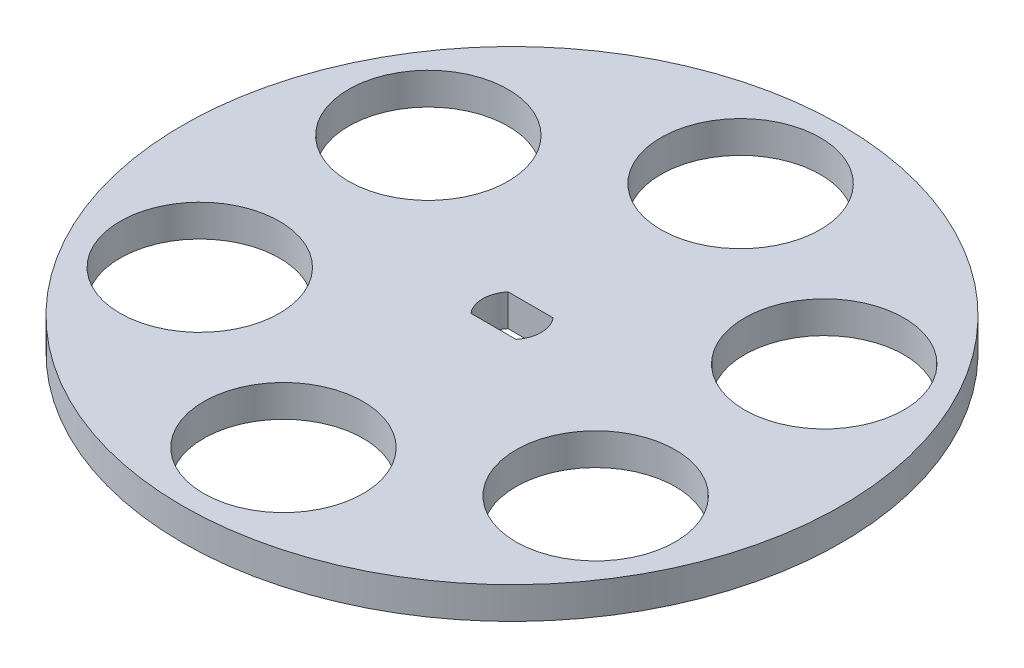
ISO-10303-21;
HEADER;
FILE_DESCRIPTION(('STEP AP214'),'2;1');
FILE_NAME('part.step','',(''),(''),'','','');
FILE_SCHEMA(('AUTOMOTIVE_DESIGN { 1 0 10303 214 1 1 1 1 }'));
ENDSEC;
DATA;
#1=APPLICATION_CONTEXT('core data for automotive mechanical design processes');
#2=APPLICATION_PROTOCOL_DEFINITION('international standard','automotive_design',2000,#1);
#3=PRODUCT_CONTEXT('',#1,'mechanical');
#4=PRODUCT('Part','Part','',(#3));
#5=PRODUCT_RELATED_PRODUCT_CATEGORY('part','',(#4));
#6=PRODUCT_DEFINITION_FORMATION('','',#4);
#7=PRODUCT_DEFINITION_CONTEXT('part definition',#1,'design');
#8=PRODUCT_DEFINITION('design','',#6,#7);
#9=PRODUCT_DEFINITION_SHAPE('','',#8);
#10=(LENGTH_UNIT() NAMED_UNIT(*) SI_UNIT(.MILLI.,.METRE.));
#11=(NAMED_UNIT(*) PLANE_ANGLE_UNIT() SI_UNIT($,.RADIAN.));
#12=(NAMED_UNIT(*) SI_UNIT($,.STERADIAN.) SOLID_ANGLE_UNIT());
#13=UNCERTAINTY_MEASURE_WITH_UNIT(LENGTH_MEASURE(1.E-05),#10,'distance_accuracy_value','');
#14=(GEOMETRIC_REPRESENTATION_CONTEXT(3) GLOBAL_UNCERTAINTY_ASSIGNED_CONTEXT((#13)) GLOBAL_UNIT_ASSIGNED_CONTEXT((#10,
#11,#12)) REPRESENTATION_CONTEXT('',''));
#15=CARTESIAN_POINT('',(0.,0.,0.));
#16=DIRECTION('',(0.,0.,1.));
#17=DIRECTION('',(1.,0.,0.));
#18=AXIS2_PLACEMENT_3D('',#15,#16,#17);
#19=CARTESIAN_POINT('',(0.,3.,0.));
#20=DIRECTION('',(0.,1.,0.));
#21=DIRECTION('',(0.,0.,1.));
#22=AXIS2_PLACEMENT_3D('',#19,#20,#21);
#23=PLANE('',#22);
#24=CARTESIAN_POINT('',(-18.6195461813641,3.,10.7500000000008));
#25=DIRECTION('',(0.,1.,0.));
#26=DIRECTION('',(0.,0.,1.));
#27=AXIS2_PLACEMENT_3D('',#24,#25,#26);
#28=CIRCLE('',#27,7.50000000000174);
#29=CARTESIAN_POINT('',(-18.6195461813641,3.,18.2500000000025));
#30=VERTEX_POINT('',#29);
#31=EDGE_CURVE('E226',#30,#30,#28,.T.);
#32=ORIENTED_EDGE('',*,*,#31,.F.);
#33=EDGE_LOOP('',(#32));
#34=FACE_BOUND('',#33,.T.);
#35=CARTESIAN_POINT('',(18.6195461813668,3.,10.7499999999992));
#36=DIRECTION('',(0.,1.,0.));
#37=DIRECTION('',(0.,0.,1.));
#38=AXIS2_PLACEMENT_3D('',#35,#36,#37);
#39=CIRCLE('',#38,7.50000000000118);
#40=CARTESIAN_POINT('',(18.6195461813668,3.,18.2500000000004));
#41=VERTEX_POINT('',#40);
#42=EDGE_CURVE('E238',#41,#41,#39,.T.);
#43=ORIENTED_EDGE('',*,*,#42,.F.);
#44=EDGE_LOOP('',(#43));
#45=FACE_BOUND('',#44,.T.);
#46=CARTESIAN_POINT('',(0.,3.,-21.5));
#47=DIRECTION('',(0.,1.,0.));
#48=DIRECTION('',(0.,0.,1.));
#49=AXIS2_PLACEMENT_3D('',#46,#47,#48);
#50=CIRCLE('',#49,7.5);
#51=CARTESIAN_POINT('',(0.,3.,-14.));
#52=VERTEX_POINT('',#51);
#53=EDGE_CURVE('E102',#52,#52,#50,.T.);
#54=ORIENTED_EDGE('',*,*,#53,.F.);
#55=EDGE_LOOP('',(#54));
#56=FACE_BOUND('',#55,.T.);
#57=CARTESIAN_POINT('',(0.,3.,0.));
#58=DIRECTION('',(0.,1.,0.));
#59=DIRECTION('',(0.,0.,1.));
#60=AXIS2_PLACEMENT_3D('',#57,#58,#59);
#61=CIRCLE('',#60,31.);
#62=CARTESIAN_POINT('',(0.,3.,31.));
#63=VERTEX_POINT('',#62);
#64=EDGE_CURVE('E11',#63,#63,#61,.T.);
#65=ORIENTED_EDGE('',*,*,#64,.T.);
#66=EDGE_LOOP('',(#65));
#67=FACE_BOUND('',#66,.T.);
#68=DIRECTION('',(1.,0.,0.));
#69=VECTOR('',#68,1.);
#70=CARTESIAN_POINT('',(-2.12132034355964,3.,1.75));
#71=LINE('',#70,#69);
#72=CARTESIAN_POINT('',(-2.12132034355964,3.,1.75));
#73=VERTEX_POINT('',#72);
#74=CARTESIAN_POINT('',(2.12132034355964,3.,1.75));
#75=VERTEX_POINT('',#74);
#76=EDGE_CURVE('E82',#73,#75,#71,.T.);
#77=ORIENTED_EDGE('',*,*,#76,.F.);
#78=CARTESIAN_POINT('',(0.,3.,0.));
#79=DIRECTION('',(0.,1.,0.));
#80=DIRECTION('',(0.,0.,1.));
#81=AXIS2_PLACEMENT_3D('',#78,#79,#80);
#82=CIRCLE('',#81,2.75);
#83=CARTESIAN_POINT('',(-2.12132034355964,3.,-1.75));
#84=VERTEX_POINT('',#83);
#85=EDGE_CURVE('E74',#84,#73,#82,.T.);
#86=ORIENTED_EDGE('',*,*,#85,.F.);
#87=DIRECTION('',(-1.,0.,0.));
#88=VECTOR('',#87,1.);
#89=CARTESIAN_POINT('',(-2.12132034355964,3.,-1.75));
#90=LINE('',#89,#88);
#91=CARTESIAN_POINT('',(2.12132034355964,3.,-1.75));
#92=VERTEX_POINT('',#91);
#93=EDGE_CURVE('E96',#92,#84,#90,.T.);
#94=ORIENTED_EDGE('',*,*,#93,.F.);
#95=CARTESIAN_POINT('',(0.,3.,0.));
#96=DIRECTION('',(0.,1.,0.));
#97=DIRECTION('',(0.,0.,1.));
#98=AXIS2_PLACEMENT_3D('',#95,#96,#97);
#99=CIRCLE('',#98,2.75);
#100=EDGE_CURVE('E94',#75,#92,#99,.T.);
#101=ORIENTED_EDGE('',*,*,#100,.F.);
#102=EDGE_LOOP('',(#77,#86,#94,#101));
#103=FACE_BOUND('',#102,.T.);
#104=CARTESIAN_POINT('',(18.6195461813659,3.,-10.7500000000008));
#105=DIRECTION('',(0.,1.,0.));
#106=DIRECTION('',(0.,0.,1.));
#107=AXIS2_PLACEMENT_3D('',#104,#105,#106);
#108=CIRCLE('',#107,7.50000000000026);
#109=CARTESIAN_POINT('',(18.6195461813659,3.,-3.25000000000054));
#110=VERTEX_POINT('',#109);
#111=EDGE_CURVE('E244',#110,#110,#108,.T.);
#112=ORIENTED_EDGE('',*,*,#111,.F.);
#113=EDGE_LOOP('',(#112));
#114=FACE_BOUND('',#113,.T.);
#115=CARTESIAN_POINT('',(1.82530128640656E-12,3.,21.5));
#116=DIRECTION('',(0.,1.,0.));
#117=DIRECTION('',(0.,0.,1.));
#118=AXIS2_PLACEMENT_3D('',#115,#116,#117);
#119=CIRCLE('',#118,7.50000000000189);
#120=CARTESIAN_POINT('',(1.82530128640656E-12,3.,29.0000000000019));
#121=VERTEX_POINT('',#120);
#122=EDGE_CURVE('E232',#121,#121,#119,.T.);
#123=ORIENTED_EDGE('',*,*,#122,.F.);
#124=EDGE_LOOP('',(#123));
#125=FACE_BOUND('',#124,.T.);
#126=CARTESIAN_POINT('',(-18.619546181365,3.,-10.7499999999992));
#127=DIRECTION('',(0.,1.,0.));
#128=DIRECTION('',(0.,0.,1.));
#129=AXIS2_PLACEMENT_3D('',#126,#127,#128);
#130=CIRCLE('',#129,7.50000000000092);
#131=CARTESIAN_POINT('',(-18.619546181365,3.,-3.24999999999827));
#132=VERTEX_POINT('',#131);
#133=EDGE_CURVE('E217',#132,#132,#130,.T.);
#134=ORIENTED_EDGE('',*,*,#133,.F.);
#135=EDGE_LOOP('',(#134));
#136=FACE_BOUND('',#135,.T.);
#137=ADVANCED_FACE('F33',(#34,#45,#56,#67,#103,#114,#125,#136),#23,.T.);
#138=CARTESIAN_POINT('',(0.,0.,0.));
#139=DIRECTION('',(0.,1.,0.));
#140=DIRECTION('',(0.,0.,1.));
#141=AXIS2_PLACEMENT_3D('',#138,#139,#140);
#142=PLANE('',#141);
#143=CARTESIAN_POINT('',(0.,0.,0.));
#144=DIRECTION('',(0.,1.,0.));
#145=DIRECTION('',(0.,0.,1.));
#146=AXIS2_PLACEMENT_3D('',#143,#144,#145);
#147=CIRCLE('',#146,31.);
#148=CARTESIAN_POINT('',(0.,0.,31.));
#149=VERTEX_POINT('',#148);
#150=EDGE_CURVE('E37',#149,#149,#147,.T.);
#151=ORIENTED_EDGE('',*,*,#150,.F.);
#152=EDGE_LOOP('',(#151));
#153=FACE_BOUND('',#152,.T.);
#154=CARTESIAN_POINT('',(0.,0.,0.));
#155=DIRECTION('',(0.,1.,0.));
#156=DIRECTION('',(0.,0.,1.));
#157=AXIS2_PLACEMENT_3D('',#154,#155,#156);
#158=CIRCLE('',#157,2.75);
#159=CARTESIAN_POINT('',(-2.12132034355964,0.,-1.75));
#160=VERTEX_POINT('',#159);
#161=CARTESIAN_POINT('',(-2.12132034355964,0.,1.75));
#162=VERTEX_POINT('',#161);
#163=EDGE_CURVE('E56',#160,#162,#158,.T.);
#164=ORIENTED_EDGE('',*,*,#163,.T.);
#165=DIRECTION('',(1.,0.,0.));
#166=VECTOR('',#165,1.);
#167=CARTESIAN_POINT('',(-2.12132034355964,0.,1.75));
#168=LINE('',#167,#166);
#169=CARTESIAN_POINT('',(2.12132034355964,0.,1.75));
#170=VERTEX_POINT('',#169);
#171=EDGE_CURVE('E89',#162,#170,#168,.T.);
#172=ORIENTED_EDGE('',*,*,#171,.T.);
#173=CARTESIAN_POINT('',(0.,0.,0.));
#174=DIRECTION('',(0.,1.,0.));
#175=DIRECTION('',(0.,0.,1.));
#176=AXIS2_PLACEMENT_3D('',#173,#174,#175);
#177=CIRCLE('',#176,2.75);
#178=CARTESIAN_POINT('',(2.12132034355964,0.,-1.75));
#179=VERTEX_POINT('',#178);
#180=EDGE_CURVE('E104',#170,#179,#177,.T.);
#181=ORIENTED_EDGE('',*,*,#180,.T.);
#182=DIRECTION('',(-1.,0.,0.));
#183=VECTOR('',#182,1.);
#184=CARTESIAN_POINT('',(-2.12132034355964,0.,-1.75));
#185=LINE('',#184,#183);
#186=EDGE_CURVE('E83',#179,#160,#185,.T.);
#187=ORIENTED_EDGE('',*,*,#186,.T.);
#188=EDGE_LOOP('',(#164,#172,#181,#187));
#189=FACE_BOUND('',#188,.T.);
#190=CARTESIAN_POINT('',(0.,0.,-21.5));
#191=DIRECTION('',(0.,1.,0.));
#192=DIRECTION('',(0.,0.,1.));
#193=AXIS2_PLACEMENT_3D('',#190,#191,#192);
#194=CIRCLE('',#193,7.5);
#195=CARTESIAN_POINT('',(0.,0.,-14.));
#196=VERTEX_POINT('',#195);
#197=EDGE_CURVE('E247',#196,#196,#194,.T.);
#198=ORIENTED_EDGE('',*,*,#197,.T.);
#199=EDGE_LOOP('',(#198));
#200=FACE_BOUND('',#199,.T.);
#201=CARTESIAN_POINT('',(18.6195461813659,0.,-10.7500000000008));
#202=DIRECTION('',(0.,1.,0.));
#203=DIRECTION('',(0.,0.,1.));
#204=AXIS2_PLACEMENT_3D('',#201,#202,#203);
#205=CIRCLE('',#204,7.50000000000026);
#206=CARTESIAN_POINT('',(18.6195461813659,0.,-3.25000000000054));
#207=VERTEX_POINT('',#206);
#208=EDGE_CURVE('E241',#207,#207,#205,.T.);
#209=ORIENTED_EDGE('',*,*,#208,.T.);
#210=EDGE_LOOP('',(#209));
#211=FACE_BOUND('',#210,.T.);
#212=CARTESIAN_POINT('',(18.6195461813668,0.,10.7499999999992));
#213=DIRECTION('',(0.,1.,0.));
#214=DIRECTION('',(0.,0.,1.));
#215=AXIS2_PLACEMENT_3D('',#212,#213,#214);
#216=CIRCLE('',#215,7.50000000000118);
#217=CARTESIAN_POINT('',(18.6195461813668,0.,18.2500000000004));
#218=VERTEX_POINT('',#217);
#219=EDGE_CURVE('E235',#218,#218,#216,.T.);
#220=ORIENTED_EDGE('',*,*,#219,.T.);
#221=EDGE_LOOP('',(#220));
#222=FACE_BOUND('',#221,.T.);
#223=CARTESIAN_POINT('',(1.82530128640656E-12,0.,21.5));
#224=DIRECTION('',(0.,1.,0.));
#225=DIRECTION('',(0.,0.,1.));
#226=AXIS2_PLACEMENT_3D('',#223,#224,#225);
#227=CIRCLE('',#226,7.50000000000189);
#228=CARTESIAN_POINT('',(1.82530128640656E-12,0.,29.0000000000019));
#229=VERTEX_POINT('',#228);
#230=EDGE_CURVE('E229',#229,#229,#227,.T.);
#231=ORIENTED_EDGE('',*,*,#230,.T.);
#232=EDGE_LOOP('',(#231));
#233=FACE_BOUND('',#232,.T.);
#234=CARTESIAN_POINT('',(-18.6195461813641,0.,10.7500000000008));
#235=DIRECTION('',(0.,1.,0.));
#236=DIRECTION('',(0.,0.,1.));
#237=AXIS2_PLACEMENT_3D('',#234,#235,#236);
#238=CIRCLE('',#237,7.50000000000174);
#239=CARTESIAN_POINT('',(-18.6195461813641,0.,18.2500000000025));
#240=VERTEX_POINT('',#239);
#241=EDGE_CURVE('E223',#240,#240,#238,.T.);
#242=ORIENTED_EDGE('',*,*,#241,.T.);
#243=EDGE_LOOP('',(#242));
#244=FACE_BOUND('',#243,.T.);
#245=CARTESIAN_POINT('',(-18.619546181365,0.,-10.7499999999992));
#246=DIRECTION('',(0.,1.,0.));
#247=DIRECTION('',(0.,0.,1.));
#248=AXIS2_PLACEMENT_3D('',#245,#246,#247);
#249=CIRCLE('',#248,7.50000000000092);
#250=CARTESIAN_POINT('',(-18.619546181365,0.,-3.24999999999827));
#251=VERTEX_POINT('',#250);
#252=EDGE_CURVE('E220',#251,#251,#249,.T.);
#253=ORIENTED_EDGE('',*,*,#252,.T.);
#254=EDGE_LOOP('',(#253));
#255=FACE_BOUND('',#254,.T.);
#256=ADVANCED_FACE('F115',(#153,#189,#200,#211,#222,#233,#244,#255),#142,.F.);
#257=CARTESIAN_POINT('',(0.,3.,0.));
#258=DIRECTION('',(0.,-1.,0.));
#259=DIRECTION('',(0.,0.,-1.));
#260=AXIS2_PLACEMENT_3D('',#257,#258,#259);
#261=CYLINDRICAL_SURFACE('',#260,31.);
#262=ORIENTED_EDGE('',*,*,#64,.F.);
#263=EDGE_LOOP('',(#262));
#264=FACE_BOUND('',#263,.T.);
#265=ORIENTED_EDGE('',*,*,#150,.T.);
#266=EDGE_LOOP('',(#265));
#267=FACE_BOUND('',#266,.T.);
#268=ADVANCED_FACE('F35',(#264,#267),#261,.T.);
#269=CARTESIAN_POINT('',(0.,3.,0.));
#270=DIRECTION('',(0.,-1.,0.));
#271=DIRECTION('',(0.,0.,-1.));
#272=AXIS2_PLACEMENT_3D('',#269,#270,#271);
#273=CYLINDRICAL_SURFACE('',#272,2.75);
#274=ORIENTED_EDGE('',*,*,#163,.F.);
#275=DIRECTION('',(0.,-1.,0.));
#276=VECTOR('',#275,1.);
#277=CARTESIAN_POINT('',(-2.12132034355964,3.,-1.75));
#278=LINE('',#277,#276);
#279=EDGE_CURVE('E78',#84,#160,#278,.T.);
#280=ORIENTED_EDGE('',*,*,#279,.F.);
#281=ORIENTED_EDGE('',*,*,#85,.T.);
#282=DIRECTION('',(0.,-1.,0.));
#283=VECTOR('',#282,1.);
#284=CARTESIAN_POINT('',(-2.12132034355964,3.,1.75));
#285=LINE('',#284,#283);
#286=EDGE_CURVE('E77',#73,#162,#285,.T.);
#287=ORIENTED_EDGE('',*,*,#286,.T.);
#288=EDGE_LOOP('',(#274,#280,#281,#287));
#289=FACE_BOUND('',#288,.T.);
#290=ADVANCED_FACE('F76',(#289),#273,.F.);
#291=CARTESIAN_POINT('',(-2.12132034355964,3.,1.75));
#292=DIRECTION('',(0.,0.,-1.));
#293=DIRECTION('',(-1.,0.,0.));
#294=AXIS2_PLACEMENT_3D('',#291,#292,#293);
#295=PLANE('',#294);
#296=ORIENTED_EDGE('',*,*,#171,.F.);
#297=ORIENTED_EDGE('',*,*,#286,.F.);
#298=ORIENTED_EDGE('',*,*,#76,.T.);
#299=DIRECTION('',(0.,-1.,0.));
#300=VECTOR('',#299,1.);
#301=CARTESIAN_POINT('',(2.12132034355964,3.,1.75));
#302=LINE('',#301,#300);
#303=EDGE_CURVE('E90',#75,#170,#302,.T.);
#304=ORIENTED_EDGE('',*,*,#303,.T.);
#305=EDGE_LOOP('',(#296,#297,#298,#304));
#306=FACE_BOUND('',#305,.T.);
#307=ADVANCED_FACE('F86',(#306),#295,.T.);
#308=CARTESIAN_POINT('',(0.,3.,0.));
#309=DIRECTION('',(0.,-1.,0.));
#310=DIRECTION('',(0.,0.,-1.));
#311=AXIS2_PLACEMENT_3D('',#308,#309,#310);
#312=CYLINDRICAL_SURFACE('',#311,2.75);
#313=ORIENTED_EDGE('',*,*,#180,.F.);
#314=ORIENTED_EDGE('',*,*,#303,.F.);
#315=ORIENTED_EDGE('',*,*,#100,.T.);
#316=DIRECTION('',(0.,-1.,0.));
#317=VECTOR('',#316,1.);
#318=CARTESIAN_POINT('',(2.12132034355964,3.,-1.75));
#319=LINE('',#318,#317);
#320=EDGE_CURVE('E48',#92,#179,#319,.T.);
#321=ORIENTED_EDGE('',*,*,#320,.T.);
#322=EDGE_LOOP('',(#313,#314,#315,#321));
#323=FACE_BOUND('',#322,.T.);
#324=ADVANCED_FACE('F113',(#323),#312,.F.);
#325=CARTESIAN_POINT('',(-2.12132034355964,3.,-1.75));
#326=DIRECTION('',(0.,0.,1.));
#327=DIRECTION('',(1.,0.,0.));
#328=AXIS2_PLACEMENT_3D('',#325,#326,#327);
#329=PLANE('',#328);
#330=ORIENTED_EDGE('',*,*,#186,.F.);
#331=ORIENTED_EDGE('',*,*,#320,.F.);
#332=ORIENTED_EDGE('',*,*,#93,.T.);
#333=ORIENTED_EDGE('',*,*,#279,.T.);
#334=EDGE_LOOP('',(#330,#331,#332,#333));
#335=FACE_BOUND('',#334,.T.);
#336=ADVANCED_FACE('F117',(#335),#329,.T.);
#337=CARTESIAN_POINT('',(0.,3.,-21.5));
#338=DIRECTION('',(0.,-1.,0.));
#339=DIRECTION('',(0.,0.,-1.));
#340=AXIS2_PLACEMENT_3D('',#337,#338,#339);
#341=CYLINDRICAL_SURFACE('',#340,7.5);
#342=ORIENTED_EDGE('',*,*,#53,.T.);
#343=EDGE_LOOP('',(#342));
#344=FACE_BOUND('',#343,.T.);
#345=ORIENTED_EDGE('',*,*,#197,.F.);
#346=EDGE_LOOP('',(#345));
#347=FACE_BOUND('',#346,.T.);
#348=ADVANCED_FACE('F119',(#344,#347),#341,.F.);
#349=CARTESIAN_POINT('',(18.6195461813659,3.,-10.7500000000008));
#350=DIRECTION('',(0.,-1.,0.));
#351=DIRECTION('',(0.,0.,-1.));
#352=AXIS2_PLACEMENT_3D('',#349,#350,#351);
#353=CYLINDRICAL_SURFACE('',#352,7.50000000000026);
#354=ORIENTED_EDGE('',*,*,#111,.T.);
#355=EDGE_LOOP('',(#354));
#356=FACE_BOUND('',#355,.T.);
#357=ORIENTED_EDGE('',*,*,#208,.F.);
#358=EDGE_LOOP('',(#357));
#359=FACE_BOUND('',#358,.T.);
#360=ADVANCED_FACE('F125',(#356,#359),#353,.F.);
#361=CARTESIAN_POINT('',(18.6195461813668,3.,10.7499999999992));
#362=DIRECTION('',(0.,-1.,0.));
#363=DIRECTION('',(0.,0.,-1.));
#364=AXIS2_PLACEMENT_3D('',#361,#362,#363);
#365=CYLINDRICAL_SURFACE('',#364,7.50000000000118);
#366=ORIENTED_EDGE('',*,*,#42,.T.);
#367=EDGE_LOOP('',(#366));
#368=FACE_BOUND('',#367,.T.);
#369=ORIENTED_EDGE('',*,*,#219,.F.);
#370=EDGE_LOOP('',(#369));
#371=FACE_BOUND('',#370,.T.);
#372=ADVANCED_FACE('F170',(#368,#371),#365,.F.);
#373=CARTESIAN_POINT('',(1.82530128640656E-12,3.,21.5));
#374=DIRECTION('',(0.,-1.,0.));
#375=DIRECTION('',(0.,0.,-1.));
#376=AXIS2_PLACEMENT_3D('',#373,#374,#375);
#377=CYLINDRICAL_SURFACE('',#376,7.50000000000189);
#378=ORIENTED_EDGE('',*,*,#122,.T.);
#379=EDGE_LOOP('',(#378));
#380=FACE_BOUND('',#379,.T.);
#381=ORIENTED_EDGE('',*,*,#230,.F.);
#382=EDGE_LOOP('',(#381));
#383=FACE_BOUND('',#382,.T.);
#384=ADVANCED_FACE('F180',(#380,#383),#377,.F.);
#385=CARTESIAN_POINT('',(-18.6195461813641,3.,10.7500000000008));
#386=DIRECTION('',(0.,-1.,0.));
#387=DIRECTION('',(0.,0.,-1.));
#388=AXIS2_PLACEMENT_3D('',#385,#386,#387);
#389=CYLINDRICAL_SURFACE('',#388,7.50000000000174);
#390=ORIENTED_EDGE('',*,*,#31,.T.);
#391=EDGE_LOOP('',(#390));
#392=FACE_BOUND('',#391,.T.);
#393=ORIENTED_EDGE('',*,*,#241,.F.);
#394=EDGE_LOOP('',(#393));
#395=FACE_BOUND('',#394,.T.);
#396=ADVANCED_FACE('F190',(#392,#395),#389,.F.);
#397=CARTESIAN_POINT('',(-18.619546181365,3.,-10.7499999999992));
#398=DIRECTION('',(0.,-1.,0.));
#399=DIRECTION('',(0.,0.,-1.));
#400=AXIS2_PLACEMENT_3D('',#397,#398,#399);
#401=CYLINDRICAL_SURFACE('',#400,7.50000000000092);
#402=ORIENTED_EDGE('',*,*,#133,.T.);
#403=EDGE_LOOP('',(#402));
#404=FACE_BOUND('',#403,.T.);
#405=ORIENTED_EDGE('',*,*,#252,.F.);
#406=EDGE_LOOP('',(#405));
#407=FACE_BOUND('',#406,.T.);
#408=ADVANCED_FACE('F200',(#404,#407),#401,.F.);
#409=CLOSED_SHELL('',(#137,#256,#268,#290,#307,#324,#336,#348,#360,#372,#384,#396,#408));
#410=MANIFOLD_SOLID_BREP('B2',#409);
#411=ADVANCED_BREP_SHAPE_REPRESENTATION('',(#18,#410),#14);
#412=SHAPE_DEFINITION_REPRESENTATION(#9,#411);
ENDSEC;
END-ISO-10303-21;
